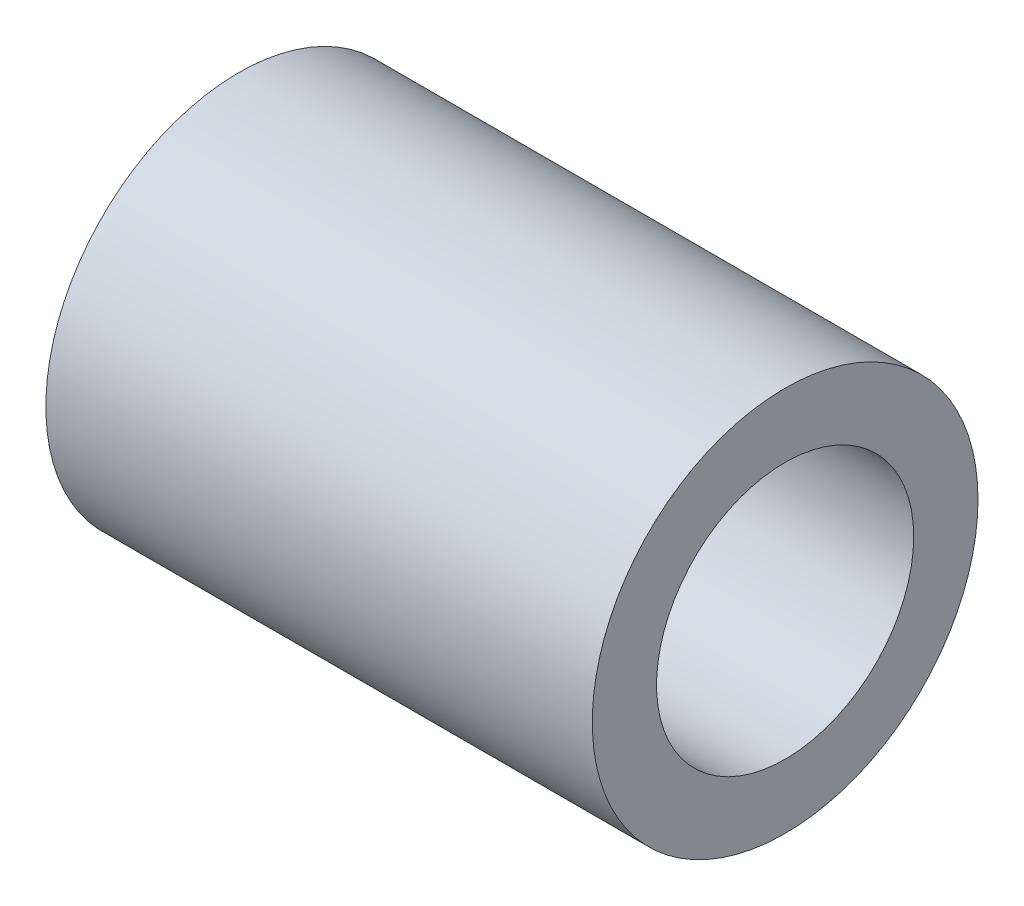
ISO-10303-21;
HEADER;
FILE_DESCRIPTION(('STEP AP214'),'2;1');
FILE_NAME('part.step','',(''),(''),'','','');
FILE_SCHEMA(('AUTOMOTIVE_DESIGN { 1 0 10303 214 1 1 1 1 }'));
ENDSEC;
DATA;
#1=APPLICATION_CONTEXT('core data for automotive mechanical design processes');
#2=APPLICATION_PROTOCOL_DEFINITION('international standard','automotive_design',2000,#1);
#3=PRODUCT_CONTEXT('',#1,'mechanical');
#4=PRODUCT('Part','Part','',(#3));
#5=PRODUCT_RELATED_PRODUCT_CATEGORY('part','',(#4));
#6=PRODUCT_DEFINITION_FORMATION('','',#4);
#7=PRODUCT_DEFINITION_CONTEXT('part definition',#1,'design');
#8=PRODUCT_DEFINITION('design','',#6,#7);
#9=PRODUCT_DEFINITION_SHAPE('','',#8);
#10=(LENGTH_UNIT() NAMED_UNIT(*) SI_UNIT(.MILLI.,.METRE.));
#11=(NAMED_UNIT(*) PLANE_ANGLE_UNIT() SI_UNIT($,.RADIAN.));
#12=(NAMED_UNIT(*) SI_UNIT($,.STERADIAN.) SOLID_ANGLE_UNIT());
#13=UNCERTAINTY_MEASURE_WITH_UNIT(LENGTH_MEASURE(1.E-05),#10,'distance_accuracy_value','');
#14=(GEOMETRIC_REPRESENTATION_CONTEXT(3) GLOBAL_UNCERTAINTY_ASSIGNED_CONTEXT((#13)) GLOBAL_UNIT_ASSIGNED_CONTEXT((#10,
#11,#12)) REPRESENTATION_CONTEXT('',''));
#15=CARTESIAN_POINT('',(0.,0.,0.));
#16=DIRECTION('',(0.,0.,1.));
#17=DIRECTION('',(1.,0.,0.));
#18=AXIS2_PLACEMENT_3D('',#15,#16,#17);
#19=CARTESIAN_POINT('',(17.,0.,0.));
#20=DIRECTION('',(1.,0.,0.));
#21=DIRECTION('',(0.,0.,-1.));
#22=AXIS2_PLACEMENT_3D('',#19,#20,#21);
#23=PLANE('',#22);
#24=CARTESIAN_POINT('',(17.,0.,0.));
#25=DIRECTION('',(1.,0.,0.));
#26=DIRECTION('',(0.,0.,-1.));
#27=AXIS2_PLACEMENT_3D('',#24,#25,#26);
#28=CIRCLE('',#27,6.);
#29=CARTESIAN_POINT('',(17.,0.,-6.));
#30=VERTEX_POINT('',#29);
#31=EDGE_CURVE('E10',#30,#30,#28,.T.);
#32=ORIENTED_EDGE('',*,*,#31,.T.);
#33=EDGE_LOOP('',(#32));
#34=FACE_BOUND('',#33,.T.);
#35=CARTESIAN_POINT('',(17.,0.,0.));
#36=DIRECTION('',(1.,0.,0.));
#37=DIRECTION('',(0.,0.,-1.));
#38=AXIS2_PLACEMENT_3D('',#35,#36,#37);
#39=CIRCLE('',#38,4.);
#40=CARTESIAN_POINT('',(17.,0.,-4.));
#41=VERTEX_POINT('',#40);
#42=EDGE_CURVE('E41',#41,#41,#39,.T.);
#43=ORIENTED_EDGE('',*,*,#42,.F.);
#44=EDGE_LOOP('',(#43));
#45=FACE_BOUND('',#44,.T.);
#46=ADVANCED_FACE('F30',(#34,#45),#23,.T.);
#47=CARTESIAN_POINT('',(0.,0.,0.));
#48=DIRECTION('',(1.,0.,0.));
#49=DIRECTION('',(0.,0.,-1.));
#50=AXIS2_PLACEMENT_3D('',#47,#48,#49);
#51=PLANE('',#50);
#52=CARTESIAN_POINT('',(0.,0.,0.));
#53=DIRECTION('',(1.,0.,0.));
#54=DIRECTION('',(0.,0.,-1.));
#55=AXIS2_PLACEMENT_3D('',#52,#53,#54);
#56=CIRCLE('',#55,6.);
#57=CARTESIAN_POINT('',(0.,0.,-6.));
#58=VERTEX_POINT('',#57);
#59=EDGE_CURVE('E34',#58,#58,#56,.T.);
#60=ORIENTED_EDGE('',*,*,#59,.F.);
#61=EDGE_LOOP('',(#60));
#62=FACE_BOUND('',#61,.T.);
#63=CARTESIAN_POINT('',(0.,0.,0.));
#64=DIRECTION('',(1.,0.,0.));
#65=DIRECTION('',(0.,0.,-1.));
#66=AXIS2_PLACEMENT_3D('',#63,#64,#65);
#67=CIRCLE('',#66,4.);
#68=CARTESIAN_POINT('',(0.,0.,-4.));
#69=VERTEX_POINT('',#68);
#70=EDGE_CURVE('E43',#69,#69,#67,.T.);
#71=ORIENTED_EDGE('',*,*,#70,.T.);
#72=EDGE_LOOP('',(#71));
#73=FACE_BOUND('',#72,.T.);
#74=ADVANCED_FACE('F53',(#62,#73),#51,.F.);
#75=CARTESIAN_POINT('',(17.,0.,0.));
#76=DIRECTION('',(-1.,0.,0.));
#77=DIRECTION('',(0.,0.,1.));
#78=AXIS2_PLACEMENT_3D('',#75,#76,#77);
#79=CYLINDRICAL_SURFACE('',#78,6.);
#80=ORIENTED_EDGE('',*,*,#31,.F.);
#81=EDGE_LOOP('',(#80));
#82=FACE_BOUND('',#81,.T.);
#83=ORIENTED_EDGE('',*,*,#59,.T.);
#84=EDGE_LOOP('',(#83));
#85=FACE_BOUND('',#84,.T.);
#86=ADVANCED_FACE('F32',(#82,#85),#79,.T.);
#87=CARTESIAN_POINT('',(17.,0.,0.));
#88=DIRECTION('',(-1.,0.,0.));
#89=DIRECTION('',(0.,0.,1.));
#90=AXIS2_PLACEMENT_3D('',#87,#88,#89);
#91=CYLINDRICAL_SURFACE('',#90,4.);
#92=ORIENTED_EDGE('',*,*,#42,.T.);
#93=EDGE_LOOP('',(#92));
#94=FACE_BOUND('',#93,.T.);
#95=ORIENTED_EDGE('',*,*,#70,.F.);
#96=EDGE_LOOP('',(#95));
#97=FACE_BOUND('',#96,.T.);
#98=ADVANCED_FACE('F49',(#94,#97),#91,.F.);
#99=CLOSED_SHELL('',(#46,#74,#86,#98));
#100=MANIFOLD_SOLID_BREP('B2',#99);
#101=ADVANCED_BREP_SHAPE_REPRESENTATION('',(#18,#100),#14);
#102=SHAPE_DEFINITION_REPRESENTATION(#9,#101);
ENDSEC;
END-ISO-10303-21;
